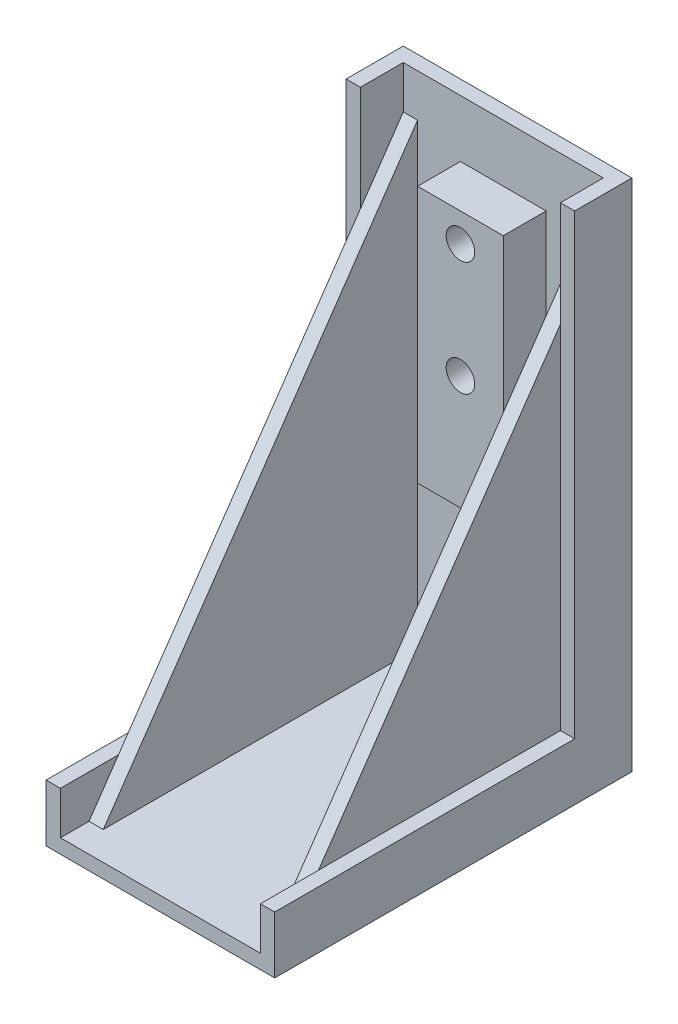
ISO-10303-21;
HEADER;
FILE_DESCRIPTION(('STEP AP214'),'2;1');
FILE_NAME('part.step','',(''),(''),'','','');
FILE_SCHEMA(('AUTOMOTIVE_DESIGN { 1 0 10303 214 1 1 1 1 }'));
ENDSEC;
DATA;
#1=APPLICATION_CONTEXT('core data for automotive mechanical design processes');
#2=APPLICATION_PROTOCOL_DEFINITION('international standard','automotive_design',2000,#1);
#3=PRODUCT_CONTEXT('',#1,'mechanical');
#4=PRODUCT('Part','Part','',(#3));
#5=PRODUCT_RELATED_PRODUCT_CATEGORY('part','',(#4));
#6=PRODUCT_DEFINITION_FORMATION('','',#4);
#7=PRODUCT_DEFINITION_CONTEXT('part definition',#1,'design');
#8=PRODUCT_DEFINITION('design','',#6,#7);
#9=PRODUCT_DEFINITION_SHAPE('','',#8);
#10=(LENGTH_UNIT() NAMED_UNIT(*) SI_UNIT(.MILLI.,.METRE.));
#11=(NAMED_UNIT(*) PLANE_ANGLE_UNIT() SI_UNIT($,.RADIAN.));
#12=(NAMED_UNIT(*) SI_UNIT($,.STERADIAN.) SOLID_ANGLE_UNIT());
#13=UNCERTAINTY_MEASURE_WITH_UNIT(LENGTH_MEASURE(1.E-05),#10,'distance_accuracy_value','');
#14=(GEOMETRIC_REPRESENTATION_CONTEXT(3) GLOBAL_UNCERTAINTY_ASSIGNED_CONTEXT((#13)) GLOBAL_UNIT_ASSIGNED_CONTEXT((#10,
#11,#12)) REPRESENTATION_CONTEXT('',''));
#15=CARTESIAN_POINT('',(0.,0.,0.));
#16=DIRECTION('',(0.,0.,1.));
#17=DIRECTION('',(1.,0.,0.));
#18=AXIS2_PLACEMENT_3D('',#15,#16,#17);
#19=CARTESIAN_POINT('',(8.75,-1.25,-16.25));
#20=DIRECTION('',(0.,0.,-1.));
#21=DIRECTION('',(-1.,0.,0.));
#22=AXIS2_PLACEMENT_3D('',#19,#20,#21);
#23=PLANE('',#22);
#24=DIRECTION('',(0.,-1.,0.));
#25=VECTOR('',#24,1.);
#26=CARTESIAN_POINT('',(7.5,38.75,-16.25));
#27=LINE('',#26,#25);
#28=CARTESIAN_POINT('',(7.5,38.75,-16.25));
#29=VERTEX_POINT('',#28);
#30=CARTESIAN_POINT('',(7.5,-1.25,-16.25));
#31=VERTEX_POINT('',#30);
#32=EDGE_CURVE('E245',#29,#31,#27,.T.);
#33=ORIENTED_EDGE('',*,*,#32,.F.);
#34=DIRECTION('',(-1.,0.,0.));
#35=VECTOR('',#34,1.);
#36=CARTESIAN_POINT('',(8.75,38.75,-16.25));
#37=LINE('',#36,#35);
#38=CARTESIAN_POINT('',(8.75,38.75,-16.25));
#39=VERTEX_POINT('',#38);
#40=EDGE_CURVE('E243',#39,#29,#37,.T.);
#41=ORIENTED_EDGE('',*,*,#40,.F.);
#42=DIRECTION('',(0.,1.,0.));
#43=VECTOR('',#42,1.);
#44=CARTESIAN_POINT('',(8.75,-1.25,-16.25));
#45=LINE('',#44,#43);
#46=CARTESIAN_POINT('',(8.75,42.5,-16.25));
#47=VERTEX_POINT('',#46);
#48=EDGE_CURVE('E443',#39,#47,#45,.T.);
#49=ORIENTED_EDGE('',*,*,#48,.T.);
#50=DIRECTION('',(1.,0.,0.));
#51=VECTOR('',#50,1.);
#52=CARTESIAN_POINT('',(0.,42.5,-16.25));
#53=LINE('',#52,#51);
#54=CARTESIAN_POINT('',(-8.74999999999999,42.5,-16.25));
#55=VERTEX_POINT('',#54);
#56=EDGE_CURVE('E276',#55,#47,#53,.T.);
#57=ORIENTED_EDGE('',*,*,#56,.F.);
#58=DIRECTION('',(0.,1.,0.));
#59=VECTOR('',#58,1.);
#60=CARTESIAN_POINT('',(-8.75,-1.25,-16.25));
#61=LINE('',#60,#59);
#62=CARTESIAN_POINT('',(-8.75,38.75,-16.25));
#63=VERTEX_POINT('',#62);
#64=EDGE_CURVE('E440',#63,#55,#61,.T.);
#65=ORIENTED_EDGE('',*,*,#64,.F.);
#66=DIRECTION('',(-1.,0.,0.));
#67=VECTOR('',#66,1.);
#68=CARTESIAN_POINT('',(-8.74999999999999,38.75,-16.25));
#69=LINE('',#68,#67);
#70=CARTESIAN_POINT('',(-7.49999999999999,38.75,-16.25));
#71=VERTEX_POINT('',#70);
#72=EDGE_CURVE('E233',#71,#63,#69,.T.);
#73=ORIENTED_EDGE('',*,*,#72,.F.);
#74=DIRECTION('',(0.,-1.,0.));
#75=VECTOR('',#74,1.);
#76=CARTESIAN_POINT('',(-7.49999999999999,38.75,-16.25));
#77=LINE('',#76,#75);
#78=CARTESIAN_POINT('',(-7.49999999999999,-1.25,-16.25));
#79=VERTEX_POINT('',#78);
#80=EDGE_CURVE('E236',#71,#79,#77,.T.);
#81=ORIENTED_EDGE('',*,*,#80,.T.);
#82=DIRECTION('',(-1.,0.,0.));
#83=VECTOR('',#82,1.);
#84=CARTESIAN_POINT('',(8.75,-1.25,-16.25));
#85=LINE('',#84,#83);
#86=EDGE_CURVE('E307',#31,#79,#85,.T.);
#87=ORIENTED_EDGE('',*,*,#86,.F.);
#88=EDGE_LOOP('',(#33,#41,#49,#57,#65,#73,#81,#87));
#89=FACE_BOUND('',#88,.T.);
#90=DIRECTION('',(0.,1.,0.));
#91=VECTOR('',#90,1.);
#92=CARTESIAN_POINT('',(3.75,37.5,-16.25));
#93=LINE('',#92,#91);
#94=CARTESIAN_POINT('',(3.75,15.,-16.25));
#95=VERTEX_POINT('',#94);
#96=CARTESIAN_POINT('',(3.75,37.5,-16.25));
#97=VERTEX_POINT('',#96);
#98=EDGE_CURVE('E206',#95,#97,#93,.T.);
#99=ORIENTED_EDGE('',*,*,#98,.F.);
#100=DIRECTION('',(1.,0.,0.));
#101=VECTOR('',#100,1.);
#102=CARTESIAN_POINT('',(-3.75,15.,-16.25));
#103=LINE('',#102,#101);
#104=CARTESIAN_POINT('',(-3.75,15.,-16.25));
#105=VERTEX_POINT('',#104);
#106=EDGE_CURVE('E203',#105,#95,#103,.T.);
#107=ORIENTED_EDGE('',*,*,#106,.F.);
#108=DIRECTION('',(0.,-1.,0.));
#109=VECTOR('',#108,1.);
#110=CARTESIAN_POINT('',(-3.75,37.5,-16.25));
#111=LINE('',#110,#109);
#112=CARTESIAN_POINT('',(-3.75,37.5,-16.25));
#113=VERTEX_POINT('',#112);
#114=EDGE_CURVE('E57',#113,#105,#111,.T.);
#115=ORIENTED_EDGE('',*,*,#114,.F.);
#116=DIRECTION('',(-1.,0.,0.));
#117=VECTOR('',#116,1.);
#118=CARTESIAN_POINT('',(-3.75,37.5,-16.25));
#119=LINE('',#118,#117);
#120=EDGE_CURVE('E52',#97,#113,#119,.T.);
#121=ORIENTED_EDGE('',*,*,#120,.F.);
#122=EDGE_LOOP('',(#99,#107,#115,#121));
#123=FACE_BOUND('',#122,.T.);
#124=ADVANCED_FACE('F35',(#89,#123),#23,.F.);
#125=CARTESIAN_POINT('',(8.75,38.75,-16.25));
#126=DIRECTION('',(-1.,0.,0.));
#127=DIRECTION('',(0.,0.,1.));
#128=AXIS2_PLACEMENT_3D('',#125,#126,#127);
#129=PLANE('',#128);
#130=DIRECTION('',(0.,-0.824041924199368,0.566528822887065));
#131=VECTOR('',#130,1.);
#132=CARTESIAN_POINT('',(8.75,38.75,-16.25));
#133=LINE('',#132,#131);
#134=CARTESIAN_POINT('',(8.75,33.2954545454545,-12.5));
#135=VERTEX_POINT('',#134);
#136=CARTESIAN_POINT('',(8.75,2.5,8.671875));
#137=VERTEX_POINT('',#136);
#138=EDGE_CURVE('E223',#135,#137,#133,.T.);
#139=ORIENTED_EDGE('',*,*,#138,.T.);
#140=DIRECTION('',(0.,0.,1.));
#141=VECTOR('',#140,1.);
#142=CARTESIAN_POINT('',(8.75,2.5,0.));
#143=LINE('',#142,#141);
#144=CARTESIAN_POINT('',(8.75,2.5,-12.5));
#145=VERTEX_POINT('',#144);
#146=EDGE_CURVE('E252',#145,#137,#143,.T.);
#147=ORIENTED_EDGE('',*,*,#146,.F.);
#148=DIRECTION('',(0.,-1.,0.));
#149=VECTOR('',#148,1.);
#150=CARTESIAN_POINT('',(8.75,42.5,-12.5));
#151=LINE('',#150,#149);
#152=EDGE_CURVE('E281',#135,#145,#151,.T.);
#153=ORIENTED_EDGE('',*,*,#152,.F.);
#154=EDGE_LOOP('',(#139,#147,#153));
#155=FACE_BOUND('',#154,.T.);
#156=ADVANCED_FACE('F356',(#155),#129,.F.);
#157=CARTESIAN_POINT('',(7.5,38.75,-16.25));
#158=DIRECTION('',(1.,0.,0.));
#159=DIRECTION('',(0.,0.,-1.));
#160=AXIS2_PLACEMENT_3D('',#157,#158,#159);
#161=PLANE('',#160);
#162=DIRECTION('',(0.,-0.824041924199368,0.566528822887065));
#163=VECTOR('',#162,1.);
#164=CARTESIAN_POINT('',(7.5,38.75,-16.25));
#165=LINE('',#164,#163);
#166=CARTESIAN_POINT('',(7.5,-1.25,11.25));
#167=VERTEX_POINT('',#166);
#168=EDGE_CURVE('E230',#29,#167,#165,.T.);
#169=ORIENTED_EDGE('',*,*,#168,.F.);
#170=ORIENTED_EDGE('',*,*,#32,.T.);
#171=DIRECTION('',(0.,0.,1.));
#172=VECTOR('',#171,1.);
#173=CARTESIAN_POINT('',(7.5,-1.25,-16.25));
#174=LINE('',#173,#172);
#175=EDGE_CURVE('E242',#31,#167,#174,.T.);
#176=ORIENTED_EDGE('',*,*,#175,.T.);
#177=EDGE_LOOP('',(#169,#170,#176));
#178=FACE_BOUND('',#177,.T.);
#179=ADVANCED_FACE('F362',(#178),#161,.F.);
#180=CARTESIAN_POINT('',(-8.74999999999999,38.75,-16.25));
#181=DIRECTION('',(1.,0.,0.));
#182=DIRECTION('',(0.,0.,-1.));
#183=AXIS2_PLACEMENT_3D('',#180,#181,#182);
#184=PLANE('',#183);
#185=DIRECTION('',(0.,-0.824041924199368,0.566528822887065));
#186=VECTOR('',#185,1.);
#187=CARTESIAN_POINT('',(-8.75,38.75,-16.25));
#188=LINE('',#187,#186);
#189=CARTESIAN_POINT('',(-8.75,33.295454545453,-12.499999999999));
#190=VERTEX_POINT('',#189);
#191=CARTESIAN_POINT('',(-8.75,2.5,8.671875));
#192=VERTEX_POINT('',#191);
#193=EDGE_CURVE('E228',#190,#192,#188,.T.);
#194=ORIENTED_EDGE('',*,*,#193,.F.);
#195=DIRECTION('',(0.,-1.,0.));
#196=VECTOR('',#195,1.);
#197=CARTESIAN_POINT('',(-8.75,42.5,-12.499999999999));
#198=LINE('',#197,#196);
#199=CARTESIAN_POINT('',(-8.74999999999999,2.5,-12.5));
#200=VERTEX_POINT('',#199);
#201=EDGE_CURVE('E301',#190,#200,#198,.T.);
#202=ORIENTED_EDGE('',*,*,#201,.T.);
#203=DIRECTION('',(0.,0.,1.));
#204=VECTOR('',#203,1.);
#205=CARTESIAN_POINT('',(-8.74999999999999,2.5,12.5));
#206=LINE('',#205,#204);
#207=EDGE_CURVE('E300',#200,#192,#206,.T.);
#208=ORIENTED_EDGE('',*,*,#207,.T.);
#209=EDGE_LOOP('',(#194,#202,#208));
#210=FACE_BOUND('',#209,.T.);
#211=ADVANCED_FACE('F506',(#210),#184,.F.);
#212=CARTESIAN_POINT('',(-7.49999999999999,38.75,-16.25));
#213=DIRECTION('',(-1.,0.,0.));
#214=DIRECTION('',(0.,0.,1.));
#215=AXIS2_PLACEMENT_3D('',#212,#213,#214);
#216=PLANE('',#215);
#217=DIRECTION('',(0.,0.824041924199368,-0.566528822887065));
#218=VECTOR('',#217,1.);
#219=CARTESIAN_POINT('',(-7.49999999999999,38.75,-16.25));
#220=LINE('',#219,#218);
#221=CARTESIAN_POINT('',(-7.49999999999999,-1.25,11.25));
#222=VERTEX_POINT('',#221);
#223=EDGE_CURVE('E227',#222,#71,#220,.T.);
#224=ORIENTED_EDGE('',*,*,#223,.F.);
#225=DIRECTION('',(0.,0.,-1.));
#226=VECTOR('',#225,1.);
#227=CARTESIAN_POINT('',(-7.49999999999999,-1.25,-16.25));
#228=LINE('',#227,#226);
#229=EDGE_CURVE('E237',#222,#79,#228,.T.);
#230=ORIENTED_EDGE('',*,*,#229,.T.);
#231=ORIENTED_EDGE('',*,*,#80,.F.);
#232=EDGE_LOOP('',(#224,#230,#231));
#233=FACE_BOUND('',#232,.T.);
#234=ADVANCED_FACE('F501',(#233),#216,.F.);
#235=CARTESIAN_POINT('',(0.,-1.25,0.));
#236=DIRECTION('',(0.,1.,0.));
#237=DIRECTION('',(0.,0.,1.));
#238=AXIS2_PLACEMENT_3D('',#235,#236,#237);
#239=PLANE('',#238);
#240=ORIENTED_EDGE('',*,*,#229,.F.);
#241=DIRECTION('',(1.,0.,0.));
#242=VECTOR('',#241,1.);
#243=CARTESIAN_POINT('',(-8.74999999999999,-1.25,11.25));
#244=LINE('',#243,#242);
#245=CARTESIAN_POINT('',(-8.75,-1.25,11.25));
#246=VERTEX_POINT('',#245);
#247=EDGE_CURVE('E232',#246,#222,#244,.T.);
#248=ORIENTED_EDGE('',*,*,#247,.F.);
#249=DIRECTION('',(0.,0.,1.));
#250=VECTOR('',#249,1.);
#251=CARTESIAN_POINT('',(-8.74999999999999,-1.25,12.5));
#252=LINE('',#251,#250);
#253=CARTESIAN_POINT('',(-8.74999999999999,-1.25,13.75));
#254=VERTEX_POINT('',#253);
#255=EDGE_CURVE('E428',#246,#254,#252,.T.);
#256=ORIENTED_EDGE('',*,*,#255,.T.);
#257=DIRECTION('',(1.,0.,0.));
#258=VECTOR('',#257,1.);
#259=CARTESIAN_POINT('',(-8.74999999999999,-1.25,13.75));
#260=LINE('',#259,#258);
#261=CARTESIAN_POINT('',(8.75,-1.25,13.75));
#262=VERTEX_POINT('',#261);
#263=EDGE_CURVE('E459',#254,#262,#260,.T.);
#264=ORIENTED_EDGE('',*,*,#263,.T.);
#265=DIRECTION('',(0.,0.,-1.));
#266=VECTOR('',#265,1.);
#267=CARTESIAN_POINT('',(8.75,-1.25,13.75));
#268=LINE('',#267,#266);
#269=CARTESIAN_POINT('',(8.75,-1.25,11.25));
#270=VERTEX_POINT('',#269);
#271=EDGE_CURVE('E453',#262,#270,#268,.T.);
#272=ORIENTED_EDGE('',*,*,#271,.T.);
#273=DIRECTION('',(1.,0.,0.));
#274=VECTOR('',#273,1.);
#275=CARTESIAN_POINT('',(8.75,-1.25,11.25));
#276=LINE('',#275,#274);
#277=EDGE_CURVE('E246',#167,#270,#276,.T.);
#278=ORIENTED_EDGE('',*,*,#277,.F.);
#279=ORIENTED_EDGE('',*,*,#175,.F.);
#280=ORIENTED_EDGE('',*,*,#86,.T.);
#281=EDGE_LOOP('',(#240,#248,#256,#264,#272,#278,#279,#280));
#282=FACE_BOUND('',#281,.T.);
#283=ADVANCED_FACE('F368',(#282),#239,.T.);
#284=CARTESIAN_POINT('',(-8.74999999999999,-1.25,12.5));
#285=DIRECTION('',(-1.,0.,0.));
#286=DIRECTION('',(0.,0.,1.));
#287=AXIS2_PLACEMENT_3D('',#284,#285,#286);
#288=PLANE('',#287);
#289=ORIENTED_EDGE('',*,*,#255,.F.);
#290=EDGE_CURVE('E222',#192,#246,#188,.T.);
#291=ORIENTED_EDGE('',*,*,#290,.F.);
#292=CARTESIAN_POINT('',(-8.74999999999999,2.5,13.75));
#293=VERTEX_POINT('',#292);
#294=EDGE_CURVE('E294',#192,#293,#206,.T.);
#295=ORIENTED_EDGE('',*,*,#294,.T.);
#296=DIRECTION('',(0.,1.,0.));
#297=VECTOR('',#296,1.);
#298=CARTESIAN_POINT('',(-8.74999999999999,-1.25,13.75));
#299=LINE('',#298,#297);
#300=EDGE_CURVE('E448',#254,#293,#299,.T.);
#301=ORIENTED_EDGE('',*,*,#300,.F.);
#302=EDGE_LOOP('',(#289,#291,#295,#301));
#303=FACE_BOUND('',#302,.T.);
#304=ADVANCED_FACE('F374',(#303),#288,.F.);
#305=CARTESIAN_POINT('',(8.75,-1.25,12.5));
#306=DIRECTION('',(1.,0.,0.));
#307=DIRECTION('',(0.,0.,-1.));
#308=AXIS2_PLACEMENT_3D('',#305,#306,#307);
#309=PLANE('',#308);
#310=DIRECTION('',(0.,0.,-1.));
#311=VECTOR('',#310,1.);
#312=CARTESIAN_POINT('',(8.75,2.5,12.5));
#313=LINE('',#312,#311);
#314=CARTESIAN_POINT('',(8.75,2.5,13.75));
#315=VERTEX_POINT('',#314);
#316=EDGE_CURVE('E316',#315,#137,#313,.T.);
#317=ORIENTED_EDGE('',*,*,#316,.T.);
#318=EDGE_CURVE('E218',#137,#270,#133,.T.);
#319=ORIENTED_EDGE('',*,*,#318,.T.);
#320=ORIENTED_EDGE('',*,*,#271,.F.);
#321=DIRECTION('',(0.,1.,0.));
#322=VECTOR('',#321,1.);
#323=CARTESIAN_POINT('',(8.75,-1.25,13.75));
#324=LINE('',#323,#322);
#325=EDGE_CURVE('E409',#262,#315,#324,.T.);
#326=ORIENTED_EDGE('',*,*,#325,.T.);
#327=EDGE_LOOP('',(#317,#319,#320,#326));
#328=FACE_BOUND('',#327,.T.);
#329=ADVANCED_FACE('F370',(#328),#309,.F.);
#330=ORIENTED_EDGE('',*,*,#48,.F.);
#331=EDGE_CURVE('E219',#39,#135,#133,.T.);
#332=ORIENTED_EDGE('',*,*,#331,.T.);
#333=CARTESIAN_POINT('',(8.75,42.5,-12.5));
#334=VERTEX_POINT('',#333);
#335=EDGE_CURVE('E327',#334,#135,#151,.T.);
#336=ORIENTED_EDGE('',*,*,#335,.F.);
#337=DIRECTION('',(0.,0.,1.));
#338=VECTOR('',#337,1.);
#339=CARTESIAN_POINT('',(8.75,42.5,0.));
#340=LINE('',#339,#338);
#341=EDGE_CURVE('E279',#47,#334,#340,.T.);
#342=ORIENTED_EDGE('',*,*,#341,.F.);
#343=EDGE_LOOP('',(#330,#332,#336,#342));
#344=FACE_BOUND('',#343,.T.);
#345=ADVANCED_FACE('F373',(#344),#309,.F.);
#346=CARTESIAN_POINT('',(0.,2.5,0.));
#347=DIRECTION('',(0.,1.,0.));
#348=DIRECTION('',(0.,0.,1.));
#349=AXIS2_PLACEMENT_3D('',#346,#347,#348);
#350=PLANE('',#349);
#351=DIRECTION('',(0.,0.,-1.));
#352=VECTOR('',#351,1.);
#353=CARTESIAN_POINT('',(10.,2.5,13.75));
#354=LINE('',#353,#352);
#355=CARTESIAN_POINT('',(10.,2.5,13.75));
#356=VERTEX_POINT('',#355);
#357=CARTESIAN_POINT('',(10.,2.5,-12.5));
#358=VERTEX_POINT('',#357);
#359=EDGE_CURVE('E417',#356,#358,#354,.T.);
#360=ORIENTED_EDGE('',*,*,#359,.T.);
#361=DIRECTION('',(-1.,0.,0.));
#362=VECTOR('',#361,1.);
#363=CARTESIAN_POINT('',(0.,2.5,-12.5));
#364=LINE('',#363,#362);
#365=EDGE_CURVE('E255',#358,#145,#364,.T.);
#366=ORIENTED_EDGE('',*,*,#365,.T.);
#367=ORIENTED_EDGE('',*,*,#146,.T.);
#368=ORIENTED_EDGE('',*,*,#316,.F.);
#369=DIRECTION('',(1.,0.,0.));
#370=VECTOR('',#369,1.);
#371=CARTESIAN_POINT('',(10.,2.5,13.75));
#372=LINE('',#371,#370);
#373=EDGE_CURVE('E407',#315,#356,#372,.T.);
#374=ORIENTED_EDGE('',*,*,#373,.T.);
#375=EDGE_LOOP('',(#360,#366,#367,#368,#374));
#376=FACE_BOUND('',#375,.T.);
#377=ADVANCED_FACE('F382',(#376),#350,.T.);
#378=ORIENTED_EDGE('',*,*,#207,.F.);
#379=DIRECTION('',(-1.,0.,0.));
#380=VECTOR('',#379,1.);
#381=CARTESIAN_POINT('',(0.,2.5,-12.5));
#382=LINE('',#381,#380);
#383=CARTESIAN_POINT('',(-10.,2.5,-12.4999999999995));
#384=VERTEX_POINT('',#383);
#385=EDGE_CURVE('E262',#200,#384,#382,.T.);
#386=ORIENTED_EDGE('',*,*,#385,.T.);
#387=DIRECTION('',(0.,0.,1.));
#388=VECTOR('',#387,1.);
#389=CARTESIAN_POINT('',(-10.,2.5,13.75));
#390=LINE('',#389,#388);
#391=CARTESIAN_POINT('',(-10.,2.5,13.75));
#392=VERTEX_POINT('',#391);
#393=EDGE_CURVE('E317',#384,#392,#390,.T.);
#394=ORIENTED_EDGE('',*,*,#393,.T.);
#395=EDGE_CURVE('E414',#392,#293,#372,.T.);
#396=ORIENTED_EDGE('',*,*,#395,.T.);
#397=ORIENTED_EDGE('',*,*,#294,.F.);
#398=EDGE_LOOP('',(#378,#386,#394,#396,#397));
#399=FACE_BOUND('',#398,.T.);
#400=ADVANCED_FACE('F385',(#399),#350,.T.);
#401=CARTESIAN_POINT('',(-10.,2.5,13.75));
#402=DIRECTION('',(1.,0.,0.));
#403=DIRECTION('',(0.,0.,-1.));
#404=AXIS2_PLACEMENT_3D('',#401,#402,#403);
#405=PLANE('',#404);
#406=DIRECTION('',(0.,0.,1.));
#407=VECTOR('',#406,1.);
#408=CARTESIAN_POINT('',(-10.,-2.5,13.75));
#409=LINE('',#408,#407);
#410=CARTESIAN_POINT('',(-10.,-2.5,-17.5));
#411=VERTEX_POINT('',#410);
#412=CARTESIAN_POINT('',(-10.,-2.5,13.75));
#413=VERTEX_POINT('',#412);
#414=EDGE_CURVE('E424',#411,#413,#409,.T.);
#415=ORIENTED_EDGE('',*,*,#414,.T.);
#416=DIRECTION('',(0.,-1.,0.));
#417=VECTOR('',#416,1.);
#418=CARTESIAN_POINT('',(-10.,2.5,13.75));
#419=LINE('',#418,#417);
#420=EDGE_CURVE('E11',#392,#413,#419,.T.);
#421=ORIENTED_EDGE('',*,*,#420,.F.);
#422=ORIENTED_EDGE('',*,*,#393,.F.);
#423=DIRECTION('',(0.,-1.,0.));
#424=VECTOR('',#423,1.);
#425=CARTESIAN_POINT('',(-10.,42.5,-12.5));
#426=LINE('',#425,#424);
#427=CARTESIAN_POINT('',(-10.,42.5,-12.5));
#428=VERTEX_POINT('',#427);
#429=EDGE_CURVE('E295',#428,#384,#426,.T.);
#430=ORIENTED_EDGE('',*,*,#429,.F.);
#431=DIRECTION('',(0.,0.,1.));
#432=VECTOR('',#431,1.);
#433=CARTESIAN_POINT('',(-10.,42.5,0.));
#434=LINE('',#433,#432);
#435=CARTESIAN_POINT('',(-10.,42.5,-17.5));
#436=VERTEX_POINT('',#435);
#437=EDGE_CURVE('E268',#436,#428,#434,.T.);
#438=ORIENTED_EDGE('',*,*,#437,.F.);
#439=DIRECTION('',(0.,-1.,0.));
#440=VECTOR('',#439,1.);
#441=CARTESIAN_POINT('',(-10.,2.5,-17.5));
#442=LINE('',#441,#440);
#443=EDGE_CURVE('E427',#436,#411,#442,.T.);
#444=ORIENTED_EDGE('',*,*,#443,.T.);
#445=EDGE_LOOP('',(#415,#421,#422,#430,#438,#444));
#446=FACE_BOUND('',#445,.T.);
#447=ADVANCED_FACE('F37',(#446),#405,.F.);
#448=CARTESIAN_POINT('',(10.,2.5,13.75));
#449=DIRECTION('',(0.,0.,-1.));
#450=DIRECTION('',(-1.,0.,0.));
#451=AXIS2_PLACEMENT_3D('',#448,#449,#450);
#452=PLANE('',#451);
#453=ORIENTED_EDGE('',*,*,#373,.F.);
#454=ORIENTED_EDGE('',*,*,#325,.F.);
#455=ORIENTED_EDGE('',*,*,#263,.F.);
#456=ORIENTED_EDGE('',*,*,#300,.T.);
#457=ORIENTED_EDGE('',*,*,#395,.F.);
#458=ORIENTED_EDGE('',*,*,#420,.T.);
#459=DIRECTION('',(1.,0.,0.));
#460=VECTOR('',#459,1.);
#461=CARTESIAN_POINT('',(10.,-2.5,13.75));
#462=LINE('',#461,#460);
#463=CARTESIAN_POINT('',(10.,-2.5,13.75));
#464=VERTEX_POINT('',#463);
#465=EDGE_CURVE('E438',#413,#464,#462,.T.);
#466=ORIENTED_EDGE('',*,*,#465,.T.);
#467=DIRECTION('',(0.,-1.,0.));
#468=VECTOR('',#467,1.);
#469=CARTESIAN_POINT('',(10.,2.5,13.75));
#470=LINE('',#469,#468);
#471=EDGE_CURVE('E44',#356,#464,#470,.T.);
#472=ORIENTED_EDGE('',*,*,#471,.F.);
#473=EDGE_LOOP('',(#453,#454,#455,#456,#457,#458,#466,#472));
#474=FACE_BOUND('',#473,.T.);
#475=ADVANCED_FACE('F396',(#474),#452,.F.);
#476=CARTESIAN_POINT('',(10.,2.5,13.75));
#477=DIRECTION('',(-1.,0.,0.));
#478=DIRECTION('',(0.,0.,1.));
#479=AXIS2_PLACEMENT_3D('',#476,#477,#478);
#480=PLANE('',#479);
#481=DIRECTION('',(0.,0.,-1.));
#482=VECTOR('',#481,1.);
#483=CARTESIAN_POINT('',(10.,-2.5,13.75));
#484=LINE('',#483,#482);
#485=CARTESIAN_POINT('',(10.,-2.5,-17.5));
#486=VERTEX_POINT('',#485);
#487=EDGE_CURVE('E437',#464,#486,#484,.T.);
#488=ORIENTED_EDGE('',*,*,#487,.T.);
#489=DIRECTION('',(0.,-1.,0.));
#490=VECTOR('',#489,1.);
#491=CARTESIAN_POINT('',(10.,2.5,-17.5));
#492=LINE('',#491,#490);
#493=CARTESIAN_POINT('',(10.,42.5,-17.5));
#494=VERTEX_POINT('',#493);
#495=EDGE_CURVE('E431',#494,#486,#492,.T.);
#496=ORIENTED_EDGE('',*,*,#495,.F.);
#497=DIRECTION('',(0.,0.,-1.));
#498=VECTOR('',#497,1.);
#499=CARTESIAN_POINT('',(10.,42.5,0.));
#500=LINE('',#499,#498);
#501=CARTESIAN_POINT('',(10.,42.5,-12.5));
#502=VERTEX_POINT('',#501);
#503=EDGE_CURVE('E261',#502,#494,#500,.T.);
#504=ORIENTED_EDGE('',*,*,#503,.F.);
#505=DIRECTION('',(0.,-1.,0.));
#506=VECTOR('',#505,1.);
#507=CARTESIAN_POINT('',(10.,42.5,-12.5));
#508=LINE('',#507,#506);
#509=EDGE_CURVE('E292',#502,#358,#508,.T.);
#510=ORIENTED_EDGE('',*,*,#509,.T.);
#511=ORIENTED_EDGE('',*,*,#359,.F.);
#512=ORIENTED_EDGE('',*,*,#471,.T.);
#513=EDGE_LOOP('',(#488,#496,#504,#510,#511,#512));
#514=FACE_BOUND('',#513,.T.);
#515=ADVANCED_FACE('F393',(#514),#480,.F.);
#516=CARTESIAN_POINT('',(10.,2.5,-17.5));
#517=DIRECTION('',(0.,0.,1.));
#518=DIRECTION('',(1.,0.,0.));
#519=AXIS2_PLACEMENT_3D('',#516,#517,#518);
#520=PLANE('',#519);
#521=CARTESIAN_POINT('',(1.04744440165294E-13,25.,-17.5));
#522=DIRECTION('',(0.,0.,1.));
#523=DIRECTION('',(1.,0.,0.));
#524=AXIS2_PLACEMENT_3D('',#521,#522,#523);
#525=CIRCLE('',#524,1.25);
#526=CARTESIAN_POINT('',(1.2500000000001,25.,-17.5));
#527=VERTEX_POINT('',#526);
#528=EDGE_CURVE('E207',#527,#527,#525,.T.);
#529=ORIENTED_EDGE('',*,*,#528,.T.);
#530=EDGE_LOOP('',(#529));
#531=FACE_BOUND('',#530,.T.);
#532=CARTESIAN_POINT('',(0.,35.,-17.5));
#533=DIRECTION('',(0.,0.,1.));
#534=DIRECTION('',(1.,0.,0.));
#535=AXIS2_PLACEMENT_3D('',#532,#533,#534);
#536=CIRCLE('',#535,1.25);
#537=CARTESIAN_POINT('',(1.25,35.,-17.5));
#538=VERTEX_POINT('',#537);
#539=EDGE_CURVE('E210',#538,#538,#536,.T.);
#540=ORIENTED_EDGE('',*,*,#539,.T.);
#541=EDGE_LOOP('',(#540));
#542=FACE_BOUND('',#541,.T.);
#543=DIRECTION('',(-1.,0.,0.));
#544=VECTOR('',#543,1.);
#545=CARTESIAN_POINT('',(10.,-2.5,-17.5));
#546=LINE('',#545,#544);
#547=EDGE_CURVE('E418',#486,#411,#546,.T.);
#548=ORIENTED_EDGE('',*,*,#547,.T.);
#549=ORIENTED_EDGE('',*,*,#443,.F.);
#550=DIRECTION('',(-1.,0.,0.));
#551=VECTOR('',#550,1.);
#552=CARTESIAN_POINT('',(0.,42.5,-17.5));
#553=LINE('',#552,#551);
#554=EDGE_CURVE('E265',#494,#436,#553,.T.);
#555=ORIENTED_EDGE('',*,*,#554,.F.);
#556=ORIENTED_EDGE('',*,*,#495,.T.);
#557=EDGE_LOOP('',(#548,#549,#555,#556));
#558=FACE_BOUND('',#557,.T.);
#559=ADVANCED_FACE('F389',(#531,#542,#558),#520,.F.);
#560=CARTESIAN_POINT('',(0.,-2.5,0.));
#561=DIRECTION('',(0.,1.,0.));
#562=DIRECTION('',(0.,0.,1.));
#563=AXIS2_PLACEMENT_3D('',#560,#561,#562);
#564=PLANE('',#563);
#565=ORIENTED_EDGE('',*,*,#414,.F.);
#566=ORIENTED_EDGE('',*,*,#547,.F.);
#567=ORIENTED_EDGE('',*,*,#487,.F.);
#568=ORIENTED_EDGE('',*,*,#465,.F.);
#569=EDGE_LOOP('',(#565,#566,#567,#568));
#570=FACE_BOUND('',#569,.T.);
#571=ADVANCED_FACE('F380',(#570),#564,.F.);
#572=CARTESIAN_POINT('',(-8.75,42.5,-12.499999999999));
#573=VERTEX_POINT('',#572);
#574=EDGE_CURVE('E323',#573,#190,#198,.T.);
#575=ORIENTED_EDGE('',*,*,#574,.T.);
#576=EDGE_CURVE('E224',#63,#190,#188,.T.);
#577=ORIENTED_EDGE('',*,*,#576,.F.);
#578=ORIENTED_EDGE('',*,*,#64,.T.);
#579=DIRECTION('',(0.,0.,-1.));
#580=VECTOR('',#579,1.);
#581=CARTESIAN_POINT('',(-8.74999999999999,42.5,0.));
#582=LINE('',#581,#580);
#583=EDGE_CURVE('E273',#573,#55,#582,.T.);
#584=ORIENTED_EDGE('',*,*,#583,.F.);
#585=EDGE_LOOP('',(#575,#577,#578,#584));
#586=FACE_BOUND('',#585,.T.);
#587=ADVANCED_FACE('F376',(#586),#288,.F.);
#588=CARTESIAN_POINT('',(0.,42.5,-12.5));
#589=DIRECTION('',(0.,0.,1.));
#590=DIRECTION('',(1.,0.,0.));
#591=AXIS2_PLACEMENT_3D('',#588,#589,#590);
#592=PLANE('',#591);
#593=ORIENTED_EDGE('',*,*,#365,.F.);
#594=ORIENTED_EDGE('',*,*,#509,.F.);
#595=DIRECTION('',(-1.,0.,0.));
#596=VECTOR('',#595,1.);
#597=CARTESIAN_POINT('',(0.,42.5,-12.5));
#598=LINE('',#597,#596);
#599=EDGE_CURVE('E258',#502,#334,#598,.T.);
#600=ORIENTED_EDGE('',*,*,#599,.T.);
#601=ORIENTED_EDGE('',*,*,#335,.T.);
#602=ORIENTED_EDGE('',*,*,#152,.T.);
#603=EDGE_LOOP('',(#593,#594,#600,#601,#602));
#604=FACE_BOUND('',#603,.T.);
#605=ADVANCED_FACE('F379',(#604),#592,.T.);
#606=CARTESIAN_POINT('',(0.,42.5,-12.5));
#607=DIRECTION('',(0.,0.,1.));
#608=DIRECTION('',(1.,0.,0.));
#609=AXIS2_PLACEMENT_3D('',#606,#607,#608);
#610=PLANE('',#609);
#611=ORIENTED_EDGE('',*,*,#385,.F.);
#612=ORIENTED_EDGE('',*,*,#201,.F.);
#613=ORIENTED_EDGE('',*,*,#574,.F.);
#614=DIRECTION('',(-1.,0.,0.));
#615=VECTOR('',#614,1.);
#616=CARTESIAN_POINT('',(0.,42.5,-12.5));
#617=LINE('',#616,#615);
#618=EDGE_CURVE('E270',#573,#428,#617,.T.);
#619=ORIENTED_EDGE('',*,*,#618,.T.);
#620=ORIENTED_EDGE('',*,*,#429,.T.);
#621=EDGE_LOOP('',(#611,#612,#613,#619,#620));
#622=FACE_BOUND('',#621,.T.);
#623=ADVANCED_FACE('F476',(#622),#610,.T.);
#624=CARTESIAN_POINT('',(0.,42.5,0.));
#625=DIRECTION('',(0.,1.,0.));
#626=DIRECTION('',(0.,0.,1.));
#627=AXIS2_PLACEMENT_3D('',#624,#625,#626);
#628=PLANE('',#627);
#629=ORIENTED_EDGE('',*,*,#599,.F.);
#630=ORIENTED_EDGE('',*,*,#503,.T.);
#631=ORIENTED_EDGE('',*,*,#554,.T.);
#632=ORIENTED_EDGE('',*,*,#437,.T.);
#633=ORIENTED_EDGE('',*,*,#618,.F.);
#634=ORIENTED_EDGE('',*,*,#583,.T.);
#635=ORIENTED_EDGE('',*,*,#56,.T.);
#636=ORIENTED_EDGE('',*,*,#341,.T.);
#637=EDGE_LOOP('',(#629,#630,#631,#632,#633,#634,#635,#636));
#638=FACE_BOUND('',#637,.T.);
#639=ADVANCED_FACE('F480',(#638),#628,.T.);
#640=CARTESIAN_POINT('',(-8.75,38.75,-16.25));
#641=DIRECTION('',(0.,0.566528822887065,0.824041924199368));
#642=DIRECTION('',(0.,-0.824041924199368,0.566528822887065));
#643=AXIS2_PLACEMENT_3D('',#640,#641,#642);
#644=PLANE('',#643);
#645=ORIENTED_EDGE('',*,*,#223,.T.);
#646=ORIENTED_EDGE('',*,*,#72,.T.);
#647=ORIENTED_EDGE('',*,*,#576,.T.);
#648=ORIENTED_EDGE('',*,*,#193,.T.);
#649=ORIENTED_EDGE('',*,*,#290,.T.);
#650=ORIENTED_EDGE('',*,*,#247,.T.);
#651=EDGE_LOOP('',(#645,#646,#647,#648,#649,#650));
#652=FACE_BOUND('',#651,.T.);
#653=ADVANCED_FACE('F503',(#652),#644,.T.);
#654=ORIENTED_EDGE('',*,*,#168,.T.);
#655=ORIENTED_EDGE('',*,*,#277,.T.);
#656=ORIENTED_EDGE('',*,*,#318,.F.);
#657=ORIENTED_EDGE('',*,*,#138,.F.);
#658=ORIENTED_EDGE('',*,*,#331,.F.);
#659=ORIENTED_EDGE('',*,*,#40,.T.);
#660=EDGE_LOOP('',(#654,#655,#656,#657,#658,#659));
#661=FACE_BOUND('',#660,.T.);
#662=ADVANCED_FACE('F494',(#661),#644,.T.);
#663=CARTESIAN_POINT('',(0.,35.,29.5));
#664=DIRECTION('',(0.,0.,-1.));
#665=DIRECTION('',(-1.,0.,0.));
#666=AXIS2_PLACEMENT_3D('',#663,#664,#665);
#667=CYLINDRICAL_SURFACE('',#666,1.25);
#668=ORIENTED_EDGE('',*,*,#539,.F.);
#669=EDGE_LOOP('',(#668));
#670=FACE_BOUND('',#669,.T.);
#671=CARTESIAN_POINT('',(0.,35.,-12.5));
#672=DIRECTION('',(0.,0.,1.));
#673=DIRECTION('',(1.,0.,0.));
#674=AXIS2_PLACEMENT_3D('',#671,#672,#673);
#675=CIRCLE('',#674,1.25);
#676=CARTESIAN_POINT('',(1.25,35.,-12.5));
#677=VERTEX_POINT('',#676);
#678=EDGE_CURVE('E335',#677,#677,#675,.T.);
#679=ORIENTED_EDGE('',*,*,#678,.T.);
#680=EDGE_LOOP('',(#679));
#681=FACE_BOUND('',#680,.T.);
#682=ADVANCED_FACE('F546',(#670,#681),#667,.F.);
#683=CARTESIAN_POINT('',(1.04744440165294E-13,25.,29.5));
#684=DIRECTION('',(0.,0.,-1.));
#685=DIRECTION('',(-1.,0.,0.));
#686=AXIS2_PLACEMENT_3D('',#683,#684,#685);
#687=CYLINDRICAL_SURFACE('',#686,1.25);
#688=ORIENTED_EDGE('',*,*,#528,.F.);
#689=EDGE_LOOP('',(#688));
#690=FACE_BOUND('',#689,.T.);
#691=CARTESIAN_POINT('',(1.05394961468785E-13,25.,-12.5));
#692=DIRECTION('',(0.,0.,1.));
#693=DIRECTION('',(1.,0.,0.));
#694=AXIS2_PLACEMENT_3D('',#691,#692,#693);
#695=CIRCLE('',#694,1.25);
#696=CARTESIAN_POINT('',(1.2500000000001,25.,-12.5));
#697=VERTEX_POINT('',#696);
#698=EDGE_CURVE('E39',#697,#697,#695,.T.);
#699=ORIENTED_EDGE('',*,*,#698,.T.);
#700=EDGE_LOOP('',(#699));
#701=FACE_BOUND('',#700,.T.);
#702=ADVANCED_FACE('F343',(#690,#701),#687,.F.);
#703=CARTESIAN_POINT('',(3.75,37.5,-12.5));
#704=DIRECTION('',(-1.,0.,0.));
#705=DIRECTION('',(0.,0.,1.));
#706=AXIS2_PLACEMENT_3D('',#703,#704,#705);
#707=PLANE('',#706);
#708=ORIENTED_EDGE('',*,*,#98,.T.);
#709=DIRECTION('',(0.,0.,-1.));
#710=VECTOR('',#709,1.);
#711=CARTESIAN_POINT('',(3.75,37.5,-12.5));
#712=LINE('',#711,#710);
#713=CARTESIAN_POINT('',(3.75,37.5,-12.5));
#714=VERTEX_POINT('',#713);
#715=EDGE_CURVE('E187',#714,#97,#712,.T.);
#716=ORIENTED_EDGE('',*,*,#715,.F.);
#717=DIRECTION('',(0.,1.,0.));
#718=VECTOR('',#717,1.);
#719=CARTESIAN_POINT('',(3.75,37.5,-12.5));
#720=LINE('',#719,#718);
#721=CARTESIAN_POINT('',(3.75,15.,-12.5));
#722=VERTEX_POINT('',#721);
#723=EDGE_CURVE('E194',#722,#714,#720,.T.);
#724=ORIENTED_EDGE('',*,*,#723,.F.);
#725=DIRECTION('',(0.,0.,-1.));
#726=VECTOR('',#725,1.);
#727=CARTESIAN_POINT('',(3.75,15.,-12.5));
#728=LINE('',#727,#726);
#729=EDGE_CURVE('E786',#722,#95,#728,.T.);
#730=ORIENTED_EDGE('',*,*,#729,.T.);
#731=EDGE_LOOP('',(#708,#716,#724,#730));
#732=FACE_BOUND('',#731,.T.);
#733=ADVANCED_FACE('F205',(#732),#707,.F.);
#734=CARTESIAN_POINT('',(-3.75,37.5,-12.5));
#735=DIRECTION('',(0.,-1.,0.));
#736=DIRECTION('',(0.,0.,-1.));
#737=AXIS2_PLACEMENT_3D('',#734,#735,#736);
#738=PLANE('',#737);
#739=ORIENTED_EDGE('',*,*,#120,.T.);
#740=DIRECTION('',(0.,0.,-1.));
#741=VECTOR('',#740,1.);
#742=CARTESIAN_POINT('',(-3.75,37.5,-12.5));
#743=LINE('',#742,#741);
#744=CARTESIAN_POINT('',(-3.75,37.5,-12.5));
#745=VERTEX_POINT('',#744);
#746=EDGE_CURVE('E190',#745,#113,#743,.T.);
#747=ORIENTED_EDGE('',*,*,#746,.F.);
#748=DIRECTION('',(-1.,0.,0.));
#749=VECTOR('',#748,1.);
#750=CARTESIAN_POINT('',(-3.75,37.5,-12.5));
#751=LINE('',#750,#749);
#752=EDGE_CURVE('E183',#714,#745,#751,.T.);
#753=ORIENTED_EDGE('',*,*,#752,.F.);
#754=ORIENTED_EDGE('',*,*,#715,.T.);
#755=EDGE_LOOP('',(#739,#747,#753,#754));
#756=FACE_BOUND('',#755,.T.);
#757=ADVANCED_FACE('F185',(#756),#738,.F.);
#758=CARTESIAN_POINT('',(-3.75,37.5,-12.5));
#759=DIRECTION('',(1.,0.,0.));
#760=DIRECTION('',(0.,0.,-1.));
#761=AXIS2_PLACEMENT_3D('',#758,#759,#760);
#762=PLANE('',#761);
#763=ORIENTED_EDGE('',*,*,#114,.T.);
#764=DIRECTION('',(0.,0.,-1.));
#765=VECTOR('',#764,1.);
#766=CARTESIAN_POINT('',(-3.75,15.,-12.5));
#767=LINE('',#766,#765);
#768=CARTESIAN_POINT('',(-3.75,15.,-12.5));
#769=VERTEX_POINT('',#768);
#770=EDGE_CURVE('E212',#769,#105,#767,.T.);
#771=ORIENTED_EDGE('',*,*,#770,.F.);
#772=DIRECTION('',(0.,-1.,0.));
#773=VECTOR('',#772,1.);
#774=CARTESIAN_POINT('',(-3.75,37.5,-12.5));
#775=LINE('',#774,#773);
#776=EDGE_CURVE('E193',#745,#769,#775,.T.);
#777=ORIENTED_EDGE('',*,*,#776,.F.);
#778=ORIENTED_EDGE('',*,*,#746,.T.);
#779=EDGE_LOOP('',(#763,#771,#777,#778));
#780=FACE_BOUND('',#779,.T.);
#781=ADVANCED_FACE('F352',(#780),#762,.F.);
#782=CARTESIAN_POINT('',(-3.75,15.,-12.5));
#783=DIRECTION('',(0.,1.,0.));
#784=DIRECTION('',(0.,0.,1.));
#785=AXIS2_PLACEMENT_3D('',#782,#783,#784);
#786=PLANE('',#785);
#787=ORIENTED_EDGE('',*,*,#106,.T.);
#788=ORIENTED_EDGE('',*,*,#729,.F.);
#789=DIRECTION('',(1.,0.,0.));
#790=VECTOR('',#789,1.);
#791=CARTESIAN_POINT('',(-3.75,15.,-12.5));
#792=LINE('',#791,#790);
#793=EDGE_CURVE('E199',#769,#722,#792,.T.);
#794=ORIENTED_EDGE('',*,*,#793,.F.);
#795=ORIENTED_EDGE('',*,*,#770,.T.);
#796=EDGE_LOOP('',(#787,#788,#794,#795));
#797=FACE_BOUND('',#796,.T.);
#798=ADVANCED_FACE('F347',(#797),#786,.F.);
#799=CARTESIAN_POINT('',(0.,0.,-12.5));
#800=DIRECTION('',(0.,0.,1.));
#801=DIRECTION('',(1.,0.,0.));
#802=AXIS2_PLACEMENT_3D('',#799,#800,#801);
#803=PLANE('',#802);
#804=ORIENTED_EDGE('',*,*,#698,.F.);
#805=EDGE_LOOP('',(#804));
#806=FACE_BOUND('',#805,.T.);
#807=ORIENTED_EDGE('',*,*,#678,.F.);
#808=EDGE_LOOP('',(#807));
#809=FACE_BOUND('',#808,.T.);
#810=ORIENTED_EDGE('',*,*,#723,.T.);
#811=ORIENTED_EDGE('',*,*,#752,.T.);
#812=ORIENTED_EDGE('',*,*,#776,.T.);
#813=ORIENTED_EDGE('',*,*,#793,.T.);
#814=EDGE_LOOP('',(#810,#811,#812,#813));
#815=FACE_BOUND('',#814,.T.);
#816=ADVANCED_FACE('F197',(#806,#809,#815),#803,.T.);
#817=CLOSED_SHELL('',(#124,#156,#179,#211,#234,#283,#304,#329,#345,#377,#400,#447,#475,#515,
#559,#571,#587,#605,#623,#639,#653,#662,#682,#702,#733,#757,#781,#798,#816));
#818=MANIFOLD_SOLID_BREP('B2',#817);
#819=ADVANCED_BREP_SHAPE_REPRESENTATION('',(#18,#818),#14);
#820=SHAPE_DEFINITION_REPRESENTATION(#9,#819);
ENDSEC;
END-ISO-10303-21;
